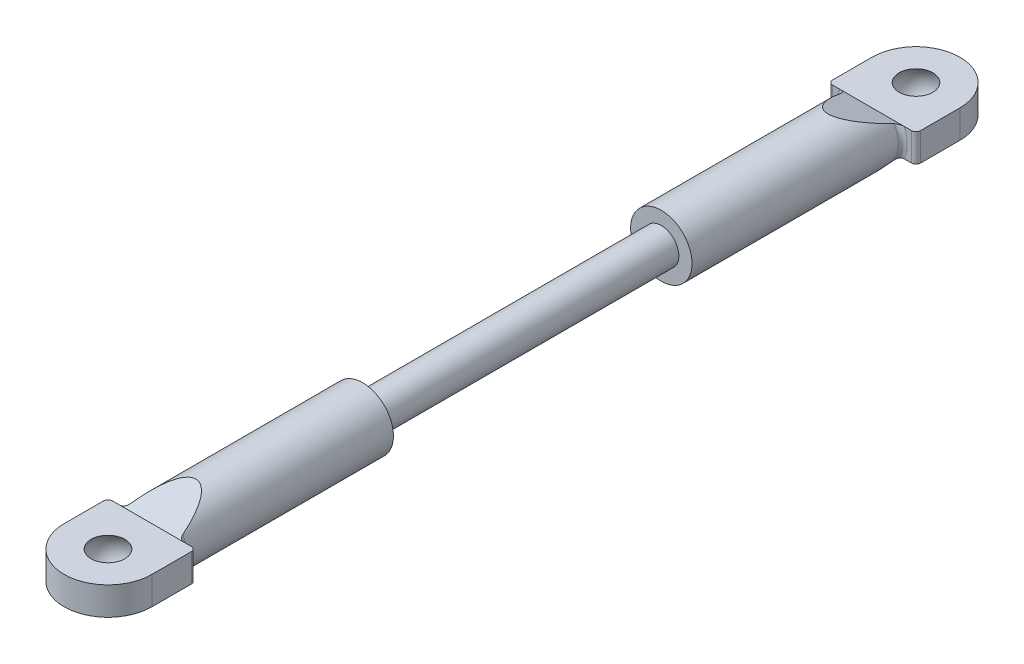
ISO-10303-21;
HEADER;
FILE_DESCRIPTION(('STEP AP214'),'2;1');
FILE_NAME('part.step','',(''),(''),'','','');
FILE_SCHEMA(('AUTOMOTIVE_DESIGN { 1 0 10303 214 1 1 1 1 }'));
ENDSEC;
DATA;
#1=APPLICATION_CONTEXT('core data for automotive mechanical design processes');
#2=APPLICATION_PROTOCOL_DEFINITION('international standard','automotive_design',2000,#1);
#3=PRODUCT_CONTEXT('',#1,'mechanical');
#4=PRODUCT('Part','Part','',(#3));
#5=PRODUCT_RELATED_PRODUCT_CATEGORY('part','',(#4));
#6=PRODUCT_DEFINITION_FORMATION('','',#4);
#7=PRODUCT_DEFINITION_CONTEXT('part definition',#1,'design');
#8=PRODUCT_DEFINITION('design','',#6,#7);
#9=PRODUCT_DEFINITION_SHAPE('','',#8);
#10=(LENGTH_UNIT() NAMED_UNIT(*) SI_UNIT(.MILLI.,.METRE.));
#11=(NAMED_UNIT(*) PLANE_ANGLE_UNIT() SI_UNIT($,.RADIAN.));
#12=(NAMED_UNIT(*) SI_UNIT($,.STERADIAN.) SOLID_ANGLE_UNIT());
#13=UNCERTAINTY_MEASURE_WITH_UNIT(LENGTH_MEASURE(1.E-05),#10,'distance_accuracy_value','');
#14=(GEOMETRIC_REPRESENTATION_CONTEXT(3) GLOBAL_UNCERTAINTY_ASSIGNED_CONTEXT((#13)) GLOBAL_UNIT_ASSIGNED_CONTEXT((#10,
#11,#12)) REPRESENTATION_CONTEXT('',''));
#15=CARTESIAN_POINT('',(0.,0.,0.));
#16=DIRECTION('',(0.,0.,1.));
#17=DIRECTION('',(1.,0.,0.));
#18=AXIS2_PLACEMENT_3D('',#15,#16,#17);
#19=CARTESIAN_POINT('',(0.,0.,-41.));
#20=DIRECTION('',(0.,0.,1.));
#21=DIRECTION('',(1.,0.,0.));
#22=AXIS2_PLACEMENT_3D('',#19,#20,#21);
#23=CYLINDRICAL_SURFACE('',#22,3.5);
#24=CARTESIAN_POINT('',(0.,0.,-17.));
#25=DIRECTION('',(0.,0.,1.));
#26=DIRECTION('',(1.,0.,0.));
#27=AXIS2_PLACEMENT_3D('',#24,#25,#26);
#28=CIRCLE('',#27,3.5);
#29=CARTESIAN_POINT('',(3.5,0.,-17.));
#30=VERTEX_POINT('',#29);
#31=EDGE_CURVE('E184',#30,#30,#28,.T.);
#32=ORIENTED_EDGE('',*,*,#31,.F.);
#33=EDGE_LOOP('',(#32));
#34=FACE_BOUND('',#33,.T.);
#35=CARTESIAN_POINT('',(0.,0.,-45.2105263157895));
#36=DIRECTION('',(0.,0.934783580588349,-0.355217760623573));
#37=DIRECTION('',(0.,0.355217760623573,0.934783580588349));
#38=AXIS2_PLACEMENT_3D('',#35,#36,#37);
#39=ELLIPSE('',#38,9.8531109307594,3.5);
#40=CARTESIAN_POINT('',(3.00764027104306,1.79,-40.5));
#41=VERTEX_POINT('',#40);
#42=CARTESIAN_POINT('',(-3.00764027104306,1.79,-40.5));
#43=VERTEX_POINT('',#42);
#44=EDGE_CURVE('E517',#41,#43,#39,.F.);
#45=ORIENTED_EDGE('',*,*,#44,.T.);
#46=CARTESIAN_POINT('',(0.,0.,-40.5));
#47=DIRECTION('',(0.,0.,1.));
#48=DIRECTION('',(1.,0.,0.));
#49=AXIS2_PLACEMENT_3D('',#46,#47,#48);
#50=CIRCLE('',#49,3.5);
#51=CARTESIAN_POINT('',(-3.00764027104306,-1.79,-40.5));
#52=VERTEX_POINT('',#51);
#53=EDGE_CURVE('E369',#43,#52,#50,.T.);
#54=ORIENTED_EDGE('',*,*,#53,.T.);
#55=CARTESIAN_POINT('',(0.,0.,-45.2105263157895));
#56=DIRECTION('',(0.,-0.934783580588349,-0.355217760623573));
#57=DIRECTION('',(0.,-0.355217760623573,0.934783580588349));
#58=AXIS2_PLACEMENT_3D('',#55,#56,#57);
#59=ELLIPSE('',#58,9.8531109307594,3.5);
#60=CARTESIAN_POINT('',(3.00764027104306,-1.79,-40.5));
#61=VERTEX_POINT('',#60);
#62=EDGE_CURVE('E208',#52,#61,#59,.F.);
#63=ORIENTED_EDGE('',*,*,#62,.T.);
#64=CARTESIAN_POINT('',(0.,0.,-40.5));
#65=DIRECTION('',(0.,0.,1.));
#66=DIRECTION('',(1.,0.,0.));
#67=AXIS2_PLACEMENT_3D('',#64,#65,#66);
#68=CIRCLE('',#67,3.5);
#69=EDGE_CURVE('E366',#61,#41,#68,.T.);
#70=ORIENTED_EDGE('',*,*,#69,.T.);
#71=EDGE_LOOP('',(#45,#54,#63,#70));
#72=FACE_BOUND('',#71,.T.);
#73=ADVANCED_FACE('F34',(#34,#72),#23,.T.);
#74=CARTESIAN_POINT('',(0.,0.,17.));
#75=DIRECTION('',(0.,0.,-1.));
#76=DIRECTION('',(-1.,0.,0.));
#77=AXIS2_PLACEMENT_3D('',#74,#75,#76);
#78=CYLINDRICAL_SURFACE('',#77,2.);
#79=CARTESIAN_POINT('',(0.,0.,17.));
#80=DIRECTION('',(0.,0.,1.));
#81=DIRECTION('',(1.,0.,0.));
#82=AXIS2_PLACEMENT_3D('',#79,#80,#81);
#83=CIRCLE('',#82,2.);
#84=CARTESIAN_POINT('',(2.,0.,17.));
#85=VERTEX_POINT('',#84);
#86=EDGE_CURVE('E267',#85,#85,#83,.T.);
#87=ORIENTED_EDGE('',*,*,#86,.F.);
#88=EDGE_LOOP('',(#87));
#89=FACE_BOUND('',#88,.T.);
#90=CARTESIAN_POINT('',(0.,0.,-17.));
#91=DIRECTION('',(0.,0.,-1.));
#92=DIRECTION('',(-1.,0.,0.));
#93=AXIS2_PLACEMENT_3D('',#90,#91,#92);
#94=CIRCLE('',#93,2.);
#95=CARTESIAN_POINT('',(-2.,0.,-17.));
#96=VERTEX_POINT('',#95);
#97=EDGE_CURVE('E219',#96,#96,#94,.T.);
#98=ORIENTED_EDGE('',*,*,#97,.F.);
#99=EDGE_LOOP('',(#98));
#100=FACE_BOUND('',#99,.T.);
#101=ADVANCED_FACE('F429',(#89,#100),#78,.T.);
#102=CARTESIAN_POINT('',(0.,0.,41.));
#103=DIRECTION('',(0.,0.,-1.));
#104=DIRECTION('',(-1.,0.,0.));
#105=AXIS2_PLACEMENT_3D('',#102,#103,#104);
#106=CYLINDRICAL_SURFACE('',#105,3.5);
#107=CARTESIAN_POINT('',(0.,0.,45.2105263157895));
#108=DIRECTION('',(0.,0.934783580588349,-0.355217760623573));
#109=DIRECTION('',(0.,-0.355217760623573,-0.934783580588349));
#110=AXIS2_PLACEMENT_3D('',#107,#108,#109);
#111=ELLIPSE('',#110,9.8531109307594,3.5);
#112=CARTESIAN_POINT('',(3.00764027104306,-1.79,40.5));
#113=VERTEX_POINT('',#112);
#114=CARTESIAN_POINT('',(-3.00764027104306,-1.79,40.5));
#115=VERTEX_POINT('',#114);
#116=EDGE_CURVE('E231',#113,#115,#111,.T.);
#117=ORIENTED_EDGE('',*,*,#116,.T.);
#118=CARTESIAN_POINT('',(0.,0.,40.5));
#119=DIRECTION('',(0.,0.,1.));
#120=DIRECTION('',(1.,0.,0.));
#121=AXIS2_PLACEMENT_3D('',#118,#119,#120);
#122=CIRCLE('',#121,3.5);
#123=CARTESIAN_POINT('',(-3.00764027104306,1.79,40.5));
#124=VERTEX_POINT('',#123);
#125=EDGE_CURVE('E288',#115,#124,#122,.F.);
#126=ORIENTED_EDGE('',*,*,#125,.T.);
#127=CARTESIAN_POINT('',(0.,0.,45.2105263157895));
#128=DIRECTION('',(0.,-0.934783580588349,-0.355217760623573));
#129=DIRECTION('',(0.,0.355217760623573,-0.934783580588349));
#130=AXIS2_PLACEMENT_3D('',#127,#128,#129);
#131=ELLIPSE('',#130,9.8531109307594,3.5);
#132=CARTESIAN_POINT('',(3.00764027104306,1.79,40.5));
#133=VERTEX_POINT('',#132);
#134=EDGE_CURVE('E228',#124,#133,#131,.T.);
#135=ORIENTED_EDGE('',*,*,#134,.T.);
#136=CARTESIAN_POINT('',(0.,0.,40.5));
#137=DIRECTION('',(0.,0.,1.));
#138=DIRECTION('',(1.,0.,0.));
#139=AXIS2_PLACEMENT_3D('',#136,#137,#138);
#140=CIRCLE('',#139,3.5);
#141=EDGE_CURVE('E286',#133,#113,#140,.F.);
#142=ORIENTED_EDGE('',*,*,#141,.T.);
#143=EDGE_LOOP('',(#117,#126,#135,#142));
#144=FACE_BOUND('',#143,.T.);
#145=CARTESIAN_POINT('',(0.,0.,17.));
#146=DIRECTION('',(0.,0.,1.));
#147=DIRECTION('',(1.,0.,0.));
#148=AXIS2_PLACEMENT_3D('',#145,#146,#147);
#149=CIRCLE('',#148,3.5);
#150=CARTESIAN_POINT('',(3.5,0.,17.));
#151=VERTEX_POINT('',#150);
#152=EDGE_CURVE('E264',#151,#151,#149,.T.);
#153=ORIENTED_EDGE('',*,*,#152,.T.);
#154=EDGE_LOOP('',(#153));
#155=FACE_BOUND('',#154,.T.);
#156=ADVANCED_FACE('F490',(#144,#155),#106,.T.);
#157=CARTESIAN_POINT('',(0.,0.,17.));
#158=DIRECTION('',(0.,0.,1.));
#159=DIRECTION('',(1.,0.,0.));
#160=AXIS2_PLACEMENT_3D('',#157,#158,#159);
#161=PLANE('',#160);
#162=ORIENTED_EDGE('',*,*,#86,.T.);
#163=EDGE_LOOP('',(#162));
#164=FACE_BOUND('',#163,.T.);
#165=ORIENTED_EDGE('',*,*,#152,.F.);
#166=EDGE_LOOP('',(#165));
#167=FACE_BOUND('',#166,.T.);
#168=ADVANCED_FACE('F493',(#164,#167),#161,.F.);
#169=CARTESIAN_POINT('',(4.99999999999988,1.6,41.));
#170=DIRECTION('',(0.,0.,1.));
#171=DIRECTION('',(1.,0.,0.));
#172=AXIS2_PLACEMENT_3D('',#169,#170,#171);
#173=PLANE('',#172);
#174=DIRECTION('',(-1.,0.,0.));
#175=VECTOR('',#174,1.);
#176=CARTESIAN_POINT('',(4.99999999999988,-1.6,41.));
#177=LINE('',#176,#175);
#178=CARTESIAN_POINT('',(-3.66606055596467,-1.6,41.));
#179=VERTEX_POINT('',#178);
#180=CARTESIAN_POINT('',(-4.50000000000012,-1.6,41.));
#181=VERTEX_POINT('',#180);
#182=EDGE_CURVE('E251',#179,#181,#177,.T.);
#183=ORIENTED_EDGE('',*,*,#182,.T.);
#184=DIRECTION('',(0.,-1.,0.));
#185=VECTOR('',#184,1.);
#186=CARTESIAN_POINT('',(-4.50000000000012,1.6,41.));
#187=LINE('',#186,#185);
#188=CARTESIAN_POINT('',(-4.50000000000012,1.6,41.));
#189=VERTEX_POINT('',#188);
#190=EDGE_CURVE('E280',#181,#189,#187,.F.);
#191=ORIENTED_EDGE('',*,*,#190,.T.);
#192=DIRECTION('',(-1.,0.,0.));
#193=VECTOR('',#192,1.);
#194=CARTESIAN_POINT('',(4.99999999999988,1.6,41.));
#195=LINE('',#194,#193);
#196=CARTESIAN_POINT('',(-3.66606055596467,1.6,41.));
#197=VERTEX_POINT('',#196);
#198=EDGE_CURVE('E238',#197,#189,#195,.T.);
#199=ORIENTED_EDGE('',*,*,#198,.F.);
#200=CARTESIAN_POINT('',(0.,0.,41.));
#201=DIRECTION('',(0.,0.,1.));
#202=DIRECTION('',(1.,0.,0.));
#203=AXIS2_PLACEMENT_3D('',#200,#201,#202);
#204=CIRCLE('',#203,4.);
#205=EDGE_CURVE('E277',#197,#179,#204,.T.);
#206=ORIENTED_EDGE('',*,*,#205,.T.);
#207=EDGE_LOOP('',(#183,#191,#199,#206));
#208=FACE_BOUND('',#207,.T.);
#209=ADVANCED_FACE('F458',(#208),#173,.F.);
#210=CARTESIAN_POINT('',(4.49999999999988,1.6,41.));
#211=VERTEX_POINT('',#210);
#212=CARTESIAN_POINT('',(3.66606055596467,1.6,41.));
#213=VERTEX_POINT('',#212);
#214=EDGE_CURVE('E240',#211,#213,#195,.T.);
#215=ORIENTED_EDGE('',*,*,#214,.F.);
#216=DIRECTION('',(0.,-1.,0.));
#217=VECTOR('',#216,1.);
#218=CARTESIAN_POINT('',(4.49999999999988,1.6,41.));
#219=LINE('',#218,#217);
#220=CARTESIAN_POINT('',(4.49999999999988,-1.6,41.));
#221=VERTEX_POINT('',#220);
#222=EDGE_CURVE('E293',#211,#221,#219,.T.);
#223=ORIENTED_EDGE('',*,*,#222,.T.);
#224=CARTESIAN_POINT('',(3.66606055596467,-1.6,41.));
#225=VERTEX_POINT('',#224);
#226=EDGE_CURVE('E252',#221,#225,#177,.T.);
#227=ORIENTED_EDGE('',*,*,#226,.T.);
#228=CARTESIAN_POINT('',(0.,0.,41.));
#229=DIRECTION('',(0.,0.,1.));
#230=DIRECTION('',(1.,0.,0.));
#231=AXIS2_PLACEMENT_3D('',#228,#229,#230);
#232=CIRCLE('',#231,4.);
#233=EDGE_CURVE('E290',#225,#213,#232,.T.);
#234=ORIENTED_EDGE('',*,*,#233,.T.);
#235=EDGE_LOOP('',(#215,#223,#227,#234));
#236=FACE_BOUND('',#235,.T.);
#237=ADVANCED_FACE('F486',(#236),#173,.F.);
#238=CARTESIAN_POINT('',(4.99999999999988,1.6,41.));
#239=DIRECTION('',(-1.,0.,0.));
#240=DIRECTION('',(0.,0.,1.));
#241=AXIS2_PLACEMENT_3D('',#238,#239,#240);
#242=PLANE('',#241);
#243=DIRECTION('',(0.,0.,-1.));
#244=VECTOR('',#243,1.);
#245=CARTESIAN_POINT('',(4.99999999999988,-1.6,41.));
#246=LINE('',#245,#244);
#247=CARTESIAN_POINT('',(4.99999999999988,-1.6,46.));
#248=VERTEX_POINT('',#247);
#249=CARTESIAN_POINT('',(4.99999999999988,-1.6,41.5));
#250=VERTEX_POINT('',#249);
#251=EDGE_CURVE('E234',#248,#250,#246,.T.);
#252=ORIENTED_EDGE('',*,*,#251,.T.);
#253=DIRECTION('',(0.,-1.,0.));
#254=VECTOR('',#253,1.);
#255=CARTESIAN_POINT('',(4.99999999999988,1.6,41.5));
#256=LINE('',#255,#254);
#257=CARTESIAN_POINT('',(4.99999999999988,1.6,41.5));
#258=VERTEX_POINT('',#257);
#259=EDGE_CURVE('E296',#250,#258,#256,.F.);
#260=ORIENTED_EDGE('',*,*,#259,.T.);
#261=DIRECTION('',(0.,0.,-1.));
#262=VECTOR('',#261,1.);
#263=CARTESIAN_POINT('',(4.99999999999988,1.6,41.));
#264=LINE('',#263,#262);
#265=CARTESIAN_POINT('',(4.99999999999988,1.6,46.));
#266=VERTEX_POINT('',#265);
#267=EDGE_CURVE('E235',#266,#258,#264,.T.);
#268=ORIENTED_EDGE('',*,*,#267,.F.);
#269=DIRECTION('',(0.,-1.,0.));
#270=VECTOR('',#269,1.);
#271=CARTESIAN_POINT('',(4.99999999999988,1.6,46.));
#272=LINE('',#271,#270);
#273=EDGE_CURVE('E248',#266,#248,#272,.T.);
#274=ORIENTED_EDGE('',*,*,#273,.T.);
#275=EDGE_LOOP('',(#252,#260,#268,#274));
#276=FACE_BOUND('',#275,.T.);
#277=ADVANCED_FACE('F480',(#276),#242,.F.);
#278=CARTESIAN_POINT('',(-5.00000000000012,1.6,41.));
#279=DIRECTION('',(1.,0.,0.));
#280=DIRECTION('',(0.,0.,-1.));
#281=AXIS2_PLACEMENT_3D('',#278,#279,#280);
#282=PLANE('',#281);
#283=DIRECTION('',(0.,0.,1.));
#284=VECTOR('',#283,1.);
#285=CARTESIAN_POINT('',(-5.00000000000012,1.6,41.));
#286=LINE('',#285,#284);
#287=CARTESIAN_POINT('',(-5.00000000000012,1.6,41.5));
#288=VERTEX_POINT('',#287);
#289=CARTESIAN_POINT('',(-5.00000000000012,1.6,46.));
#290=VERTEX_POINT('',#289);
#291=EDGE_CURVE('E243',#288,#290,#286,.T.);
#292=ORIENTED_EDGE('',*,*,#291,.F.);
#293=DIRECTION('',(0.,-1.,0.));
#294=VECTOR('',#293,1.);
#295=CARTESIAN_POINT('',(-5.00000000000012,1.6,41.5));
#296=LINE('',#295,#294);
#297=CARTESIAN_POINT('',(-5.00000000000012,-1.6,41.5));
#298=VERTEX_POINT('',#297);
#299=EDGE_CURVE('E270',#288,#298,#296,.T.);
#300=ORIENTED_EDGE('',*,*,#299,.T.);
#301=DIRECTION('',(0.,0.,1.));
#302=VECTOR('',#301,1.);
#303=CARTESIAN_POINT('',(-5.00000000000012,-1.6,41.));
#304=LINE('',#303,#302);
#305=CARTESIAN_POINT('',(-5.00000000000012,-1.6,46.));
#306=VERTEX_POINT('',#305);
#307=EDGE_CURVE('E255',#298,#306,#304,.T.);
#308=ORIENTED_EDGE('',*,*,#307,.T.);
#309=DIRECTION('',(0.,-1.,0.));
#310=VECTOR('',#309,1.);
#311=CARTESIAN_POINT('',(-5.00000000000012,1.6,46.));
#312=LINE('',#311,#310);
#313=EDGE_CURVE('E261',#290,#306,#312,.T.);
#314=ORIENTED_EDGE('',*,*,#313,.F.);
#315=EDGE_LOOP('',(#292,#300,#308,#314));
#316=FACE_BOUND('',#315,.T.);
#317=ADVANCED_FACE('F470',(#316),#282,.F.);
#318=CARTESIAN_POINT('',(-1.14925430283463E-13,1.6,46.));
#319=DIRECTION('',(0.,-1.,0.));
#320=DIRECTION('',(0.,0.,-1.));
#321=AXIS2_PLACEMENT_3D('',#318,#319,#320);
#322=CYLINDRICAL_SURFACE('',#321,5.);
#323=CARTESIAN_POINT('',(-1.14925430283463E-13,-1.6,46.));
#324=DIRECTION('',(0.,1.,0.));
#325=DIRECTION('',(0.,0.,1.));
#326=AXIS2_PLACEMENT_3D('',#323,#324,#325);
#327=CIRCLE('',#326,5.);
#328=EDGE_CURVE('E239',#306,#248,#327,.T.);
#329=ORIENTED_EDGE('',*,*,#328,.T.);
#330=ORIENTED_EDGE('',*,*,#273,.F.);
#331=CARTESIAN_POINT('',(-1.14925430283463E-13,1.6,46.));
#332=DIRECTION('',(0.,1.,0.));
#333=DIRECTION('',(0.,0.,1.));
#334=AXIS2_PLACEMENT_3D('',#331,#332,#333);
#335=CIRCLE('',#334,5.);
#336=EDGE_CURVE('E246',#290,#266,#335,.T.);
#337=ORIENTED_EDGE('',*,*,#336,.F.);
#338=ORIENTED_EDGE('',*,*,#313,.T.);
#339=EDGE_LOOP('',(#329,#330,#337,#338));
#340=FACE_BOUND('',#339,.T.);
#341=ADVANCED_FACE('F476',(#340),#322,.T.);
#342=CARTESIAN_POINT('',(-1.14925430283463E-13,1.6,46.));
#343=DIRECTION('',(0.,1.,0.));
#344=DIRECTION('',(0.,0.,1.));
#345=AXIS2_PLACEMENT_3D('',#342,#343,#344);
#346=PLANE('',#345);
#347=CARTESIAN_POINT('',(0.,1.6,46.));
#348=DIRECTION('',(0.,-1.,0.));
#349=DIRECTION('',(0.,0.,-1.));
#350=AXIS2_PLACEMENT_3D('',#347,#348,#349);
#351=CIRCLE('',#350,1.92093727122986);
#352=CARTESIAN_POINT('',(0.,1.6,44.0790627287702));
#353=VERTEX_POINT('',#352);
#354=EDGE_CURVE('E225',#353,#353,#351,.T.);
#355=ORIENTED_EDGE('',*,*,#354,.T.);
#356=EDGE_LOOP('',(#355));
#357=FACE_BOUND('',#356,.T.);
#358=ORIENTED_EDGE('',*,*,#198,.T.);
#359=CARTESIAN_POINT('',(-4.50000000000012,1.6,41.5));
#360=DIRECTION('',(0.,1.,0.));
#361=DIRECTION('',(0.,0.,1.));
#362=AXIS2_PLACEMENT_3D('',#359,#360,#361);
#363=CIRCLE('',#362,0.5);
#364=EDGE_CURVE('E284',#189,#288,#363,.T.);
#365=ORIENTED_EDGE('',*,*,#364,.T.);
#366=ORIENTED_EDGE('',*,*,#291,.T.);
#367=ORIENTED_EDGE('',*,*,#336,.T.);
#368=ORIENTED_EDGE('',*,*,#267,.T.);
#369=CARTESIAN_POINT('',(4.49999999999988,1.6,41.5));
#370=DIRECTION('',(0.,1.,0.));
#371=DIRECTION('',(0.,0.,1.));
#372=AXIS2_PLACEMENT_3D('',#369,#370,#371);
#373=CIRCLE('',#372,0.5);
#374=EDGE_CURVE('E282',#258,#211,#373,.T.);
#375=ORIENTED_EDGE('',*,*,#374,.T.);
#376=ORIENTED_EDGE('',*,*,#214,.T.);
#377=EDGE_CURVE('E244',#213,#197,#195,.T.);
#378=ORIENTED_EDGE('',*,*,#377,.T.);
#379=EDGE_LOOP('',(#358,#365,#366,#367,#368,#375,#376,#378));
#380=FACE_BOUND('',#379,.T.);
#381=ADVANCED_FACE('F466',(#357,#380),#346,.T.);
#382=CARTESIAN_POINT('',(-1.14925430283463E-13,-1.6,46.));
#383=DIRECTION('',(0.,1.,0.));
#384=DIRECTION('',(0.,0.,1.));
#385=AXIS2_PLACEMENT_3D('',#382,#383,#384);
#386=PLANE('',#385);
#387=CARTESIAN_POINT('',(0.,-1.6,46.));
#388=DIRECTION('',(0.,-1.,0.));
#389=DIRECTION('',(0.,0.,-1.));
#390=AXIS2_PLACEMENT_3D('',#387,#388,#389);
#391=CIRCLE('',#390,1.92093727122986);
#392=CARTESIAN_POINT('',(0.,-1.6,44.0790627287702));
#393=VERTEX_POINT('',#392);
#394=EDGE_CURVE('E222',#393,#393,#391,.T.);
#395=ORIENTED_EDGE('',*,*,#394,.F.);
#396=EDGE_LOOP('',(#395));
#397=FACE_BOUND('',#396,.T.);
#398=ORIENTED_EDGE('',*,*,#307,.F.);
#399=CARTESIAN_POINT('',(-4.50000000000012,-1.6,41.5));
#400=DIRECTION('',(0.,1.,0.));
#401=DIRECTION('',(0.,0.,1.));
#402=AXIS2_PLACEMENT_3D('',#399,#400,#401);
#403=CIRCLE('',#402,0.5);
#404=EDGE_CURVE('E275',#298,#181,#403,.F.);
#405=ORIENTED_EDGE('',*,*,#404,.T.);
#406=ORIENTED_EDGE('',*,*,#182,.F.);
#407=EDGE_CURVE('E256',#225,#179,#177,.T.);
#408=ORIENTED_EDGE('',*,*,#407,.F.);
#409=ORIENTED_EDGE('',*,*,#226,.F.);
#410=CARTESIAN_POINT('',(4.49999999999988,-1.6,41.5));
#411=DIRECTION('',(0.,1.,0.));
#412=DIRECTION('',(0.,0.,1.));
#413=AXIS2_PLACEMENT_3D('',#410,#411,#412);
#414=CIRCLE('',#413,0.5);
#415=EDGE_CURVE('E273',#221,#250,#414,.F.);
#416=ORIENTED_EDGE('',*,*,#415,.T.);
#417=ORIENTED_EDGE('',*,*,#251,.F.);
#418=ORIENTED_EDGE('',*,*,#328,.F.);
#419=EDGE_LOOP('',(#398,#405,#406,#408,#409,#416,#417,#418));
#420=FACE_BOUND('',#419,.T.);
#421=ADVANCED_FACE('F443',(#397,#420),#386,.F.);
#422=CARTESIAN_POINT('',(-5.00000000000012,-3.5,36.));
#423=DIRECTION('',(0.,0.934783580588349,-0.355217760623573));
#424=DIRECTION('',(0.,0.355217760623573,0.934783580588349));
#425=AXIS2_PLACEMENT_3D('',#422,#423,#424);
#426=PLANE('',#425);
#427=ORIENTED_EDGE('',*,*,#116,.F.);
#428=CARTESIAN_POINT('',(3.00764027104306,-1.79,40.5));
#429=CARTESIAN_POINT('',(3.01501660801302,-1.77766028795213,40.5324729264418));
#430=CARTESIAN_POINT('',(3.02572054444839,-1.76562370557432,40.5641481432255));
#431=CARTESIAN_POINT('',(3.05268143397384,-1.74243941655702,40.6251594301131));
#432=CARTESIAN_POINT('',(3.06890462643524,-1.73128680248825,40.6545084145046));
#433=CARTESIAN_POINT('',(3.10582578109096,-1.71005107968239,40.7103918955726));
#434=CARTESIAN_POINT('',(3.12650175541777,-1.69996306618932,40.7369392995018));
#435=CARTESIAN_POINT('',(3.17173377932212,-1.68091062474513,40.7870773033023));
#436=CARTESIAN_POINT('',(3.19630000983909,-1.67194925885705,40.810659845113));
#437=CARTESIAN_POINT('',(3.25308702665305,-1.65394324157303,40.8580441011236));
#438=CARTESIAN_POINT('',(3.28590126291054,-1.64513316555967,40.8812285116851));
#439=CARTESIAN_POINT('',(3.35512262024705,-1.62958502321958,40.922144675738));
#440=CARTESIAN_POINT('',(3.39152193222907,-1.62284257946172,40.939887948785));
#441=CARTESIAN_POINT('',(3.46667654312686,-1.61181855552478,40.9688985380927));
#442=CARTESIAN_POINT('',(3.50539569079468,-1.60750655943475,40.9802458962243));
#443=CARTESIAN_POINT('',(3.58468972563839,-1.60158887924979,40.9958187388163));
#444=CARTESIAN_POINT('',(3.62527552224046,-1.60000196579963,40.9999948268431));
#445=CARTESIAN_POINT('',(3.66606055596467,-1.6,41.));
#446=B_SPLINE_CURVE_WITH_KNOTS('',3,(#428,#429,#430,#431,#432,#433,#434,#435,#436,#437,#438,
#439,#440,#441,#442,#443,#444,#445),.UNSPECIFIED.,.F.,.F.,(4,2,2,2,2,2,2,2,4),(0.,
0.106167992198204,0.211697907824557,0.316718199165377,0.422018018143723,0.544850735918062,
0.667421577236032,0.788422358006248,0.910253310178007),.UNSPECIFIED.);
#447=EDGE_CURVE('E344',#113,#225,#446,.T.);
#448=ORIENTED_EDGE('',*,*,#447,.T.);
#449=ORIENTED_EDGE('',*,*,#407,.T.);
#450=CARTESIAN_POINT('',(-3.66606055596467,-1.6,41.));
#451=CARTESIAN_POINT('',(-3.63078063888977,-1.60000001056058,40.999999972209));
#452=CARTESIAN_POINT('',(-3.5956179181408,-1.60118986581098,40.9968687741816));
#453=CARTESIAN_POINT('',(-3.52655388189509,-1.60567025143002,40.9850782857105));
#454=CARTESIAN_POINT('',(-3.49264665949915,-1.60894911259673,40.9764497036928));
#455=CARTESIAN_POINT('',(-3.42683574135487,-1.61731864154893,40.9544246275028));
#456=CARTESIAN_POINT('',(-3.39492497711937,-1.62240243525609,40.9410462230103));
#457=CARTESIAN_POINT('',(-3.33346675755787,-1.63416518792784,40.9100916107162));
#458=CARTESIAN_POINT('',(-3.30392365430699,-1.64084699836385,40.8925078990425));
#459=CARTESIAN_POINT('',(-3.24361803739982,-1.65669629654687,40.8507992196135));
#460=CARTESIAN_POINT('',(-3.21331454976661,-1.66608478340738,40.8260926752437));
#461=CARTESIAN_POINT('',(-3.15729695298565,-1.68646854640408,40.7724511936735));
#462=CARTESIAN_POINT('',(-3.13158499781672,-1.69746457229264,40.7435142834404));
#463=CARTESIAN_POINT('',(-3.08849280363673,-1.71942769351274,40.6857165960191));
#464=CARTESIAN_POINT('',(-3.07048210952563,-1.73023882163715,40.6572662588496));
#465=CARTESIAN_POINT('',(-3.03967295120166,-1.7527379284266,40.5980580830879));
#466=CARTESIAN_POINT('',(-3.026855560671,-1.7644225359027,40.5673091160455));
#467=CARTESIAN_POINT('',(-3.01354455450079,-1.78090239560611,40.5239410641945));
#468=CARTESIAN_POINT('',(-3.01035806349222,-1.78543358828867,40.5120168729246));
#469=CARTESIAN_POINT('',(-3.00764027104306,-1.79,40.5));
#470=B_SPLINE_CURVE_WITH_KNOTS('',3,(#450,#451,#452,#453,#454,#455,#456,#457,#458,#459,#460,
#461,#462,#463,#464,#465,#466,#467,#468,#469),.UNSPECIFIED.,.F.,.F.,(4,2,2,2,2,2,2,2,2,4),(0.,
0.105514918398724,0.210445536564004,0.314980739690672,0.419703883801088,0.539819680998126,
0.659991679707302,0.765692662085833,0.871004889168675,0.910420537913499),.UNSPECIFIED.);
#471=EDGE_CURVE('E298',#179,#115,#470,.T.);
#472=ORIENTED_EDGE('',*,*,#471,.T.);
#473=EDGE_LOOP('',(#427,#448,#449,#472));
#474=FACE_BOUND('',#473,.T.);
#475=ADVANCED_FACE('F313',(#474),#426,.F.);
#476=CARTESIAN_POINT('',(-5.00000000000012,3.5,36.));
#477=DIRECTION('',(0.,-0.934783580588349,-0.355217760623573));
#478=DIRECTION('',(0.,0.355217760623573,-0.934783580588349));
#479=AXIS2_PLACEMENT_3D('',#476,#477,#478);
#480=PLANE('',#479);
#481=ORIENTED_EDGE('',*,*,#134,.F.);
#482=CARTESIAN_POINT('',(-3.00764027104306,1.79,40.5));
#483=CARTESIAN_POINT('',(-3.01501660801302,1.77766028795213,40.5324729264418));
#484=CARTESIAN_POINT('',(-3.02572054444839,1.76562370557432,40.5641481432255));
#485=CARTESIAN_POINT('',(-3.05268143397384,1.74243941655702,40.6251594301131));
#486=CARTESIAN_POINT('',(-3.06890462643524,1.73128680248825,40.6545084145046));
#487=CARTESIAN_POINT('',(-3.10582578109096,1.71005107968239,40.7103918955726));
#488=CARTESIAN_POINT('',(-3.12650175541777,1.69996306618932,40.7369392995018));
#489=CARTESIAN_POINT('',(-3.17173377932212,1.68091062474513,40.7870773033023));
#490=CARTESIAN_POINT('',(-3.19630000983909,1.67194925885705,40.810659845113));
#491=CARTESIAN_POINT('',(-3.25308702665305,1.65394324157303,40.8580441011236));
#492=CARTESIAN_POINT('',(-3.28590126291054,1.64513316555967,40.8812285116851));
#493=CARTESIAN_POINT('',(-3.35512262024705,1.62958502321958,40.922144675738));
#494=CARTESIAN_POINT('',(-3.39152193222907,1.62284257946172,40.939887948785));
#495=CARTESIAN_POINT('',(-3.46667654312686,1.61181855552478,40.9688985380927));
#496=CARTESIAN_POINT('',(-3.50539569079468,1.60750655943475,40.9802458962243));
#497=CARTESIAN_POINT('',(-3.58468972563839,1.60158887924979,40.9958187388163));
#498=CARTESIAN_POINT('',(-3.62527552224046,1.60000196579963,40.9999948268431));
#499=CARTESIAN_POINT('',(-3.66606055596467,1.6,41.));
#500=B_SPLINE_CURVE_WITH_KNOTS('',3,(#482,#483,#484,#485,#486,#487,#488,#489,#490,#491,#492,
#493,#494,#495,#496,#497,#498,#499),.UNSPECIFIED.,.F.,.F.,(4,2,2,2,2,2,2,2,4),(0.,
0.106167992198204,0.211697907824557,0.316718199165377,0.422018018143723,0.544850735918062,
0.667421577236032,0.788422358006248,0.910253310178008),.UNSPECIFIED.);
#501=EDGE_CURVE('E306',#124,#197,#500,.T.);
#502=ORIENTED_EDGE('',*,*,#501,.T.);
#503=ORIENTED_EDGE('',*,*,#377,.F.);
#504=CARTESIAN_POINT('',(3.66606055596467,1.6,41.));
#505=CARTESIAN_POINT('',(3.63078063888977,1.60000001056058,40.999999972209));
#506=CARTESIAN_POINT('',(3.5956179181408,1.60118986581098,40.9968687741816));
#507=CARTESIAN_POINT('',(3.52655388189509,1.60567025143002,40.9850782857105));
#508=CARTESIAN_POINT('',(3.49264665949915,1.60894911259673,40.9764497036928));
#509=CARTESIAN_POINT('',(3.42683574135487,1.61731864154893,40.9544246275028));
#510=CARTESIAN_POINT('',(3.39492497711937,1.62240243525609,40.9410462230103));
#511=CARTESIAN_POINT('',(3.33346675755787,1.63416518792784,40.9100916107162));
#512=CARTESIAN_POINT('',(3.30392365430699,1.64084699836385,40.8925078990425));
#513=CARTESIAN_POINT('',(3.24361803739982,1.65669629654687,40.8507992196135));
#514=CARTESIAN_POINT('',(3.21331454976661,1.66608478340738,40.8260926752437));
#515=CARTESIAN_POINT('',(3.15729695298565,1.68646854640408,40.7724511936735));
#516=CARTESIAN_POINT('',(3.13158499781672,1.69746457229264,40.7435142834404));
#517=CARTESIAN_POINT('',(3.08849280363673,1.71942769351274,40.6857165960191));
#518=CARTESIAN_POINT('',(3.07048210952563,1.73023882163715,40.6572662588496));
#519=CARTESIAN_POINT('',(3.03967295120166,1.7527379284266,40.5980580830879));
#520=CARTESIAN_POINT('',(3.026855560671,1.7644225359027,40.5673091160455));
#521=CARTESIAN_POINT('',(3.01354455450079,1.78090239560611,40.5239410641945));
#522=CARTESIAN_POINT('',(3.01035806349222,1.78543358828867,40.5120168729246));
#523=CARTESIAN_POINT('',(3.00764027104306,1.79,40.5));
#524=B_SPLINE_CURVE_WITH_KNOTS('',3,(#504,#505,#506,#507,#508,#509,#510,#511,#512,#513,#514,
#515,#516,#517,#518,#519,#520,#521,#522,#523),.UNSPECIFIED.,.F.,.F.,(4,2,2,2,2,2,2,2,2,4),(0.,
0.105514918398724,0.210445536564004,0.314980739690672,0.419703883801088,0.539819680998126,
0.659991679707302,0.765692662085833,0.871004889168674,0.910420537913499),.UNSPECIFIED.);
#525=EDGE_CURVE('E338',#213,#133,#524,.T.);
#526=ORIENTED_EDGE('',*,*,#525,.T.);
#527=EDGE_LOOP('',(#481,#502,#503,#526));
#528=FACE_BOUND('',#527,.T.);
#529=ADVANCED_FACE('F433',(#528),#480,.F.);
#530=CARTESIAN_POINT('',(-4.50000000000012,1.6,41.5));
#531=DIRECTION('',(0.,-1.,0.));
#532=DIRECTION('',(0.,0.,-1.));
#533=AXIS2_PLACEMENT_3D('',#530,#531,#532);
#534=CYLINDRICAL_SURFACE('',#533,0.5);
#535=ORIENTED_EDGE('',*,*,#364,.F.);
#536=ORIENTED_EDGE('',*,*,#190,.F.);
#537=ORIENTED_EDGE('',*,*,#404,.F.);
#538=ORIENTED_EDGE('',*,*,#299,.F.);
#539=EDGE_LOOP('',(#535,#536,#537,#538));
#540=FACE_BOUND('',#539,.T.);
#541=ADVANCED_FACE('F322',(#540),#534,.T.);
#542=CARTESIAN_POINT('',(0.,0.,40.5));
#543=DIRECTION('',(0.,0.,1.));
#544=DIRECTION('',(1.,0.,0.));
#545=AXIS2_PLACEMENT_3D('',#542,#543,#544);
#546=TOROIDAL_SURFACE('',#545,4.,0.5);
#547=ORIENTED_EDGE('',*,*,#501,.F.);
#548=ORIENTED_EDGE('',*,*,#125,.F.);
#549=ORIENTED_EDGE('',*,*,#471,.F.);
#550=ORIENTED_EDGE('',*,*,#205,.F.);
#551=EDGE_LOOP('',(#547,#548,#549,#550));
#552=FACE_BOUND('',#551,.T.);
#553=ADVANCED_FACE('F316',(#552),#546,.F.);
#554=CARTESIAN_POINT('',(4.49999999999988,1.6,41.5));
#555=DIRECTION('',(0.,-1.,0.));
#556=DIRECTION('',(0.,0.,-1.));
#557=AXIS2_PLACEMENT_3D('',#554,#555,#556);
#558=CYLINDRICAL_SURFACE('',#557,0.5);
#559=ORIENTED_EDGE('',*,*,#374,.F.);
#560=ORIENTED_EDGE('',*,*,#259,.F.);
#561=ORIENTED_EDGE('',*,*,#415,.F.);
#562=ORIENTED_EDGE('',*,*,#222,.F.);
#563=EDGE_LOOP('',(#559,#560,#561,#562));
#564=FACE_BOUND('',#563,.T.);
#565=ADVANCED_FACE('F321',(#564),#558,.T.);
#566=CARTESIAN_POINT('',(0.,0.,40.5));
#567=DIRECTION('',(0.,0.,1.));
#568=DIRECTION('',(1.,0.,0.));
#569=AXIS2_PLACEMENT_3D('',#566,#567,#568);
#570=TOROIDAL_SURFACE('',#569,4.,0.5);
#571=ORIENTED_EDGE('',*,*,#447,.F.);
#572=ORIENTED_EDGE('',*,*,#141,.F.);
#573=ORIENTED_EDGE('',*,*,#525,.F.);
#574=ORIENTED_EDGE('',*,*,#233,.F.);
#575=EDGE_LOOP('',(#571,#572,#573,#574));
#576=FACE_BOUND('',#575,.T.);
#577=ADVANCED_FACE('F328',(#576),#570,.F.);
#578=CARTESIAN_POINT('',(0.,0.,46.));
#579=DIRECTION('',(0.,-1.,0.));
#580=DIRECTION('',(0.,0.,1.));
#581=AXIS2_PLACEMENT_3D('',#578,#579,#580);
#582=SPHERICAL_SURFACE('',#581,2.5);
#583=ORIENTED_EDGE('',*,*,#394,.T.);
#584=EDGE_LOOP('',(#583));
#585=FACE_BOUND('',#584,.T.);
#586=ORIENTED_EDGE('',*,*,#354,.F.);
#587=EDGE_LOOP('',(#586));
#588=FACE_BOUND('',#587,.T.);
#589=ADVANCED_FACE('F333',(#585,#588),#582,.F.);
#590=CARTESIAN_POINT('',(0.,0.,-17.));
#591=DIRECTION('',(0.,0.,-1.));
#592=DIRECTION('',(1.,0.,0.));
#593=AXIS2_PLACEMENT_3D('',#590,#591,#592);
#594=PLANE('',#593);
#595=ORIENTED_EDGE('',*,*,#97,.T.);
#596=EDGE_LOOP('',(#595));
#597=FACE_BOUND('',#596,.T.);
#598=ORIENTED_EDGE('',*,*,#31,.T.);
#599=EDGE_LOOP('',(#598));
#600=FACE_BOUND('',#599,.T.);
#601=ADVANCED_FACE('F415',(#597,#600),#594,.F.);
#602=CARTESIAN_POINT('',(4.99999999999988,1.6,-41.));
#603=DIRECTION('',(0.,0.,1.));
#604=DIRECTION('',(1.,0.,0.));
#605=AXIS2_PLACEMENT_3D('',#602,#603,#604);
#606=PLANE('',#605);
#607=DIRECTION('',(-1.,0.,0.));
#608=VECTOR('',#607,1.);
#609=CARTESIAN_POINT('',(4.99999999999988,1.6,-41.));
#610=LINE('',#609,#608);
#611=CARTESIAN_POINT('',(-3.66606055596467,1.6,-41.));
#612=VERTEX_POINT('',#611);
#613=CARTESIAN_POINT('',(-4.50000000000012,1.6,-41.));
#614=VERTEX_POINT('',#613);
#615=EDGE_CURVE('E200',#612,#614,#610,.T.);
#616=ORIENTED_EDGE('',*,*,#615,.T.);
#617=DIRECTION('',(0.,-1.,0.));
#618=VECTOR('',#617,1.);
#619=CARTESIAN_POINT('',(-4.50000000000012,1.6,-41.));
#620=LINE('',#619,#618);
#621=CARTESIAN_POINT('',(-4.50000000000012,-1.6,-41.));
#622=VERTEX_POINT('',#621);
#623=EDGE_CURVE('E354',#614,#622,#620,.T.);
#624=ORIENTED_EDGE('',*,*,#623,.T.);
#625=DIRECTION('',(-1.,0.,0.));
#626=VECTOR('',#625,1.);
#627=CARTESIAN_POINT('',(4.99999999999988,-1.6,-41.));
#628=LINE('',#627,#626);
#629=CARTESIAN_POINT('',(-3.66606055596467,-1.6,-41.));
#630=VERTEX_POINT('',#629);
#631=EDGE_CURVE('E212',#630,#622,#628,.T.);
#632=ORIENTED_EDGE('',*,*,#631,.F.);
#633=CARTESIAN_POINT('',(0.,0.,-41.));
#634=DIRECTION('',(0.,0.,1.));
#635=DIRECTION('',(1.,0.,0.));
#636=AXIS2_PLACEMENT_3D('',#633,#634,#635);
#637=CIRCLE('',#636,4.);
#638=EDGE_CURVE('E351',#630,#612,#637,.F.);
#639=ORIENTED_EDGE('',*,*,#638,.T.);
#640=EDGE_LOOP('',(#616,#624,#632,#639));
#641=FACE_BOUND('',#640,.T.);
#642=ADVANCED_FACE('F411',(#641),#606,.T.);
#643=CARTESIAN_POINT('',(4.49999999999988,-1.6,-41.));
#644=VERTEX_POINT('',#643);
#645=CARTESIAN_POINT('',(3.66606055596467,-1.6,-41.));
#646=VERTEX_POINT('',#645);
#647=EDGE_CURVE('E193',#644,#646,#628,.T.);
#648=ORIENTED_EDGE('',*,*,#647,.F.);
#649=DIRECTION('',(0.,-1.,0.));
#650=VECTOR('',#649,1.);
#651=CARTESIAN_POINT('',(4.49999999999988,1.6,-41.));
#652=LINE('',#651,#650);
#653=CARTESIAN_POINT('',(4.49999999999988,1.6,-41.));
#654=VERTEX_POINT('',#653);
#655=EDGE_CURVE('E377',#644,#654,#652,.F.);
#656=ORIENTED_EDGE('',*,*,#655,.T.);
#657=CARTESIAN_POINT('',(3.66606055596467,1.6,-41.));
#658=VERTEX_POINT('',#657);
#659=EDGE_CURVE('E204',#654,#658,#610,.T.);
#660=ORIENTED_EDGE('',*,*,#659,.T.);
#661=CARTESIAN_POINT('',(0.,0.,-41.));
#662=DIRECTION('',(0.,0.,1.));
#663=DIRECTION('',(1.,0.,0.));
#664=AXIS2_PLACEMENT_3D('',#661,#662,#663);
#665=CIRCLE('',#664,4.);
#666=EDGE_CURVE('E374',#658,#646,#665,.F.);
#667=ORIENTED_EDGE('',*,*,#666,.T.);
#668=EDGE_LOOP('',(#648,#656,#660,#667));
#669=FACE_BOUND('',#668,.T.);
#670=ADVANCED_FACE('F414',(#669),#606,.T.);
#671=CARTESIAN_POINT('',(4.99999999999988,1.6,-41.));
#672=DIRECTION('',(1.,0.,0.));
#673=DIRECTION('',(0.,0.,-1.));
#674=AXIS2_PLACEMENT_3D('',#671,#672,#673);
#675=PLANE('',#674);
#676=DIRECTION('',(0.,0.,1.));
#677=VECTOR('',#676,1.);
#678=CARTESIAN_POINT('',(4.99999999999988,1.6,-41.));
#679=LINE('',#678,#677);
#680=CARTESIAN_POINT('',(4.99999999999988,1.6,-46.));
#681=VERTEX_POINT('',#680);
#682=CARTESIAN_POINT('',(4.99999999999988,1.6,-41.5));
#683=VERTEX_POINT('',#682);
#684=EDGE_CURVE('E176',#681,#683,#679,.T.);
#685=ORIENTED_EDGE('',*,*,#684,.T.);
#686=DIRECTION('',(0.,-1.,0.));
#687=VECTOR('',#686,1.);
#688=CARTESIAN_POINT('',(4.99999999999988,1.6,-41.5));
#689=LINE('',#688,#687);
#690=CARTESIAN_POINT('',(4.99999999999988,-1.6,-41.5));
#691=VERTEX_POINT('',#690);
#692=EDGE_CURVE('E372',#683,#691,#689,.T.);
#693=ORIENTED_EDGE('',*,*,#692,.T.);
#694=DIRECTION('',(0.,0.,1.));
#695=VECTOR('',#694,1.);
#696=CARTESIAN_POINT('',(4.99999999999988,-1.6,-41.));
#697=LINE('',#696,#695);
#698=CARTESIAN_POINT('',(4.99999999999988,-1.6,-46.));
#699=VERTEX_POINT('',#698);
#700=EDGE_CURVE('E179',#699,#691,#697,.T.);
#701=ORIENTED_EDGE('',*,*,#700,.F.);
#702=DIRECTION('',(0.,-1.,0.));
#703=VECTOR('',#702,1.);
#704=CARTESIAN_POINT('',(4.99999999999988,1.6,-46.));
#705=LINE('',#704,#703);
#706=EDGE_CURVE('E172',#681,#699,#705,.T.);
#707=ORIENTED_EDGE('',*,*,#706,.F.);
#708=EDGE_LOOP('',(#685,#693,#701,#707));
#709=FACE_BOUND('',#708,.T.);
#710=ADVANCED_FACE('F174',(#709),#675,.T.);
#711=CARTESIAN_POINT('',(-1.14925430283463E-13,1.6,-46.));
#712=DIRECTION('',(0.,-1.,0.));
#713=DIRECTION('',(0.,0.,-1.));
#714=AXIS2_PLACEMENT_3D('',#711,#712,#713);
#715=CYLINDRICAL_SURFACE('',#714,5.);
#716=CARTESIAN_POINT('',(-1.14925430283463E-13,-1.6,-46.));
#717=DIRECTION('',(0.,-1.,0.));
#718=DIRECTION('',(0.,0.,-1.));
#719=AXIS2_PLACEMENT_3D('',#716,#717,#718);
#720=CIRCLE('',#719,5.);
#721=CARTESIAN_POINT('',(-5.00000000000012,-1.6,-46.));
#722=VERTEX_POINT('',#721);
#723=EDGE_CURVE('E207',#722,#699,#720,.T.);
#724=ORIENTED_EDGE('',*,*,#723,.F.);
#725=DIRECTION('',(0.,-1.,0.));
#726=VECTOR('',#725,1.);
#727=CARTESIAN_POINT('',(-5.00000000000012,1.6,-46.));
#728=LINE('',#727,#726);
#729=CARTESIAN_POINT('',(-5.00000000000012,1.6,-46.));
#730=VERTEX_POINT('',#729);
#731=EDGE_CURVE('E185',#730,#722,#728,.T.);
#732=ORIENTED_EDGE('',*,*,#731,.F.);
#733=CARTESIAN_POINT('',(-1.14925430283463E-13,1.6,-46.));
#734=DIRECTION('',(0.,-1.,0.));
#735=DIRECTION('',(0.,0.,-1.));
#736=AXIS2_PLACEMENT_3D('',#733,#734,#735);
#737=CIRCLE('',#736,5.);
#738=EDGE_CURVE('E190',#730,#681,#737,.T.);
#739=ORIENTED_EDGE('',*,*,#738,.T.);
#740=ORIENTED_EDGE('',*,*,#706,.T.);
#741=EDGE_LOOP('',(#724,#732,#739,#740));
#742=FACE_BOUND('',#741,.T.);
#743=ADVANCED_FACE('F196',(#742),#715,.T.);
#744=CARTESIAN_POINT('',(-5.00000000000012,1.6,-41.));
#745=DIRECTION('',(-1.,0.,0.));
#746=DIRECTION('',(0.,0.,1.));
#747=AXIS2_PLACEMENT_3D('',#744,#745,#746);
#748=PLANE('',#747);
#749=DIRECTION('',(0.,0.,-1.));
#750=VECTOR('',#749,1.);
#751=CARTESIAN_POINT('',(-5.00000000000012,-1.6,-41.));
#752=LINE('',#751,#750);
#753=CARTESIAN_POINT('',(-5.00000000000012,-1.6,-41.5));
#754=VERTEX_POINT('',#753);
#755=EDGE_CURVE('E210',#754,#722,#752,.T.);
#756=ORIENTED_EDGE('',*,*,#755,.F.);
#757=DIRECTION('',(0.,-1.,0.));
#758=VECTOR('',#757,1.);
#759=CARTESIAN_POINT('',(-5.00000000000012,1.6,-41.5));
#760=LINE('',#759,#758);
#761=CARTESIAN_POINT('',(-5.00000000000012,1.6,-41.5));
#762=VERTEX_POINT('',#761);
#763=EDGE_CURVE('E361',#754,#762,#760,.F.);
#764=ORIENTED_EDGE('',*,*,#763,.T.);
#765=DIRECTION('',(0.,0.,-1.));
#766=VECTOR('',#765,1.);
#767=CARTESIAN_POINT('',(-5.00000000000012,1.6,-41.));
#768=LINE('',#767,#766);
#769=EDGE_CURVE('E198',#762,#730,#768,.T.);
#770=ORIENTED_EDGE('',*,*,#769,.T.);
#771=ORIENTED_EDGE('',*,*,#731,.T.);
#772=EDGE_LOOP('',(#756,#764,#770,#771));
#773=FACE_BOUND('',#772,.T.);
#774=ADVANCED_FACE('F406',(#773),#748,.T.);
#775=CARTESIAN_POINT('',(-1.14925430283463E-13,1.6,-46.));
#776=DIRECTION('',(0.,1.,0.));
#777=DIRECTION('',(0.,0.,-1.));
#778=AXIS2_PLACEMENT_3D('',#775,#776,#777);
#779=PLANE('',#778);
#780=CARTESIAN_POINT('',(0.,1.6,-46.));
#781=DIRECTION('',(0.,1.,0.));
#782=DIRECTION('',(0.,0.,1.));
#783=AXIS2_PLACEMENT_3D('',#780,#781,#782);
#784=CIRCLE('',#783,1.92093727122986);
#785=CARTESIAN_POINT('',(0.,1.6,-44.0790627287702));
#786=VERTEX_POINT('',#785);
#787=EDGE_CURVE('E524',#786,#786,#784,.T.);
#788=ORIENTED_EDGE('',*,*,#787,.F.);
#789=EDGE_LOOP('',(#788));
#790=FACE_BOUND('',#789,.T.);
#791=ORIENTED_EDGE('',*,*,#769,.F.);
#792=CARTESIAN_POINT('',(-4.50000000000012,1.6,-41.5));
#793=DIRECTION('',(0.,1.,0.));
#794=DIRECTION('',(0.,0.,1.));
#795=AXIS2_PLACEMENT_3D('',#792,#793,#794);
#796=CIRCLE('',#795,0.5);
#797=EDGE_CURVE('E364',#762,#614,#796,.T.);
#798=ORIENTED_EDGE('',*,*,#797,.T.);
#799=ORIENTED_EDGE('',*,*,#615,.F.);
#800=EDGE_CURVE('E56',#658,#612,#610,.T.);
#801=ORIENTED_EDGE('',*,*,#800,.F.);
#802=ORIENTED_EDGE('',*,*,#659,.F.);
#803=CARTESIAN_POINT('',(4.49999999999988,1.6,-41.5));
#804=DIRECTION('',(0.,1.,0.));
#805=DIRECTION('',(0.,0.,1.));
#806=AXIS2_PLACEMENT_3D('',#803,#804,#805);
#807=CIRCLE('',#806,0.5);
#808=EDGE_CURVE('E192',#654,#683,#807,.T.);
#809=ORIENTED_EDGE('',*,*,#808,.T.);
#810=ORIENTED_EDGE('',*,*,#684,.F.);
#811=ORIENTED_EDGE('',*,*,#738,.F.);
#812=EDGE_LOOP('',(#791,#798,#799,#801,#802,#809,#810,#811));
#813=FACE_BOUND('',#812,.T.);
#814=ADVANCED_FACE('F189',(#790,#813),#779,.T.);
#815=CARTESIAN_POINT('',(-1.14925430283463E-13,-1.6,-46.));
#816=DIRECTION('',(0.,1.,0.));
#817=DIRECTION('',(0.,0.,-1.));
#818=AXIS2_PLACEMENT_3D('',#815,#816,#817);
#819=PLANE('',#818);
#820=CARTESIAN_POINT('',(0.,-1.6,-46.));
#821=DIRECTION('',(0.,1.,0.));
#822=DIRECTION('',(0.,0.,1.));
#823=AXIS2_PLACEMENT_3D('',#820,#821,#822);
#824=CIRCLE('',#823,1.92093727122986);
#825=CARTESIAN_POINT('',(0.,-1.6,-44.0790627287702));
#826=VERTEX_POINT('',#825);
#827=EDGE_CURVE('E534',#826,#826,#824,.T.);
#828=ORIENTED_EDGE('',*,*,#827,.T.);
#829=EDGE_LOOP('',(#828));
#830=FACE_BOUND('',#829,.T.);
#831=ORIENTED_EDGE('',*,*,#631,.T.);
#832=CARTESIAN_POINT('',(-4.50000000000012,-1.6,-41.5));
#833=DIRECTION('',(0.,1.,0.));
#834=DIRECTION('',(0.,0.,1.));
#835=AXIS2_PLACEMENT_3D('',#832,#833,#834);
#836=CIRCLE('',#835,0.5);
#837=EDGE_CURVE('E359',#622,#754,#836,.F.);
#838=ORIENTED_EDGE('',*,*,#837,.T.);
#839=ORIENTED_EDGE('',*,*,#755,.T.);
#840=ORIENTED_EDGE('',*,*,#723,.T.);
#841=ORIENTED_EDGE('',*,*,#700,.T.);
#842=CARTESIAN_POINT('',(4.49999999999988,-1.6,-41.5));
#843=DIRECTION('',(0.,1.,0.));
#844=DIRECTION('',(0.,0.,1.));
#845=AXIS2_PLACEMENT_3D('',#842,#843,#844);
#846=CIRCLE('',#845,0.5);
#847=EDGE_CURVE('E357',#691,#644,#846,.F.);
#848=ORIENTED_EDGE('',*,*,#847,.T.);
#849=ORIENTED_EDGE('',*,*,#647,.T.);
#850=EDGE_CURVE('E215',#646,#630,#628,.T.);
#851=ORIENTED_EDGE('',*,*,#850,.T.);
#852=EDGE_LOOP('',(#831,#838,#839,#840,#841,#848,#849,#851));
#853=FACE_BOUND('',#852,.T.);
#854=ADVANCED_FACE('F399',(#830,#853),#819,.F.);
#855=CARTESIAN_POINT('',(-5.00000000000012,-3.5,-36.));
#856=DIRECTION('',(0.,-0.934783580588349,-0.355217760623573));
#857=DIRECTION('',(0.,0.355217760623573,-0.934783580588349));
#858=AXIS2_PLACEMENT_3D('',#855,#856,#857);
#859=PLANE('',#858);
#860=ORIENTED_EDGE('',*,*,#62,.F.);
#861=CARTESIAN_POINT('',(-3.00764027104306,-1.79,-40.5));
#862=CARTESIAN_POINT('',(-3.01501660801302,-1.77766028795213,-40.5324729264418));
#863=CARTESIAN_POINT('',(-3.02572054444839,-1.76562370557432,-40.5641481432255));
#864=CARTESIAN_POINT('',(-3.05268143397384,-1.74243941655702,-40.6251594301131));
#865=CARTESIAN_POINT('',(-3.06890462643524,-1.73128680248825,-40.6545084145046));
#866=CARTESIAN_POINT('',(-3.10582578109096,-1.71005107968239,-40.7103918955726));
#867=CARTESIAN_POINT('',(-3.12650175541777,-1.69996306618932,-40.7369392995018));
#868=CARTESIAN_POINT('',(-3.17173377932212,-1.68091062474513,-40.7870773033023));
#869=CARTESIAN_POINT('',(-3.19630000983909,-1.67194925885705,-40.810659845113));
#870=CARTESIAN_POINT('',(-3.25308702665305,-1.65394324157303,-40.8580441011236));
#871=CARTESIAN_POINT('',(-3.28590126291054,-1.64513316555967,-40.8812285116851));
#872=CARTESIAN_POINT('',(-3.35512262024705,-1.62958502321958,-40.922144675738));
#873=CARTESIAN_POINT('',(-3.39152193222907,-1.62284257946172,-40.939887948785));
#874=CARTESIAN_POINT('',(-3.46667654312686,-1.61181855552478,-40.9688985380927));
#875=CARTESIAN_POINT('',(-3.50539569079468,-1.60750655943475,-40.9802458962243));
#876=CARTESIAN_POINT('',(-3.58468972563839,-1.60158887924979,-40.9958187388163));
#877=CARTESIAN_POINT('',(-3.62527552224046,-1.60000196579963,-40.9999948268431));
#878=CARTESIAN_POINT('',(-3.66606055596467,-1.6,-41.));
#879=B_SPLINE_CURVE_WITH_KNOTS('',3,(#861,#862,#863,#864,#865,#866,#867,#868,#869,#870,#871,
#872,#873,#874,#875,#876,#877,#878),.UNSPECIFIED.,.F.,.F.,(4,2,2,2,2,2,2,2,4),(0.,
0.106167992198204,0.211697907824557,0.316718199165377,0.422018018143723,0.544850735918062,
0.667421577236032,0.788422358006248,0.910253310178008),.UNSPECIFIED.);
#880=EDGE_CURVE('E379',#52,#630,#879,.T.);
#881=ORIENTED_EDGE('',*,*,#880,.T.);
#882=ORIENTED_EDGE('',*,*,#850,.F.);
#883=CARTESIAN_POINT('',(3.66606055596467,-1.6,-41.));
#884=CARTESIAN_POINT('',(3.63078063888977,-1.60000001056058,-40.999999972209));
#885=CARTESIAN_POINT('',(3.5956179181408,-1.60118986581098,-40.9968687741816));
#886=CARTESIAN_POINT('',(3.52655388189509,-1.60567025143002,-40.9850782857105));
#887=CARTESIAN_POINT('',(3.49264665949915,-1.60894911259673,-40.9764497036928));
#888=CARTESIAN_POINT('',(3.42683574135487,-1.61731864154893,-40.9544246275028));
#889=CARTESIAN_POINT('',(3.39492497711937,-1.62240243525609,-40.9410462230103));
#890=CARTESIAN_POINT('',(3.33346675755787,-1.63416518792784,-40.9100916107162));
#891=CARTESIAN_POINT('',(3.30392365430699,-1.64084699836385,-40.8925078990425));
#892=CARTESIAN_POINT('',(3.24361803739982,-1.65669629654687,-40.8507992196135));
#893=CARTESIAN_POINT('',(3.21331454976661,-1.66608478340738,-40.8260926752437));
#894=CARTESIAN_POINT('',(3.15729695298565,-1.68646854640408,-40.7724511936735));
#895=CARTESIAN_POINT('',(3.13158499781672,-1.69746457229264,-40.7435142834404));
#896=CARTESIAN_POINT('',(3.08849280363673,-1.71942769351274,-40.6857165960191));
#897=CARTESIAN_POINT('',(3.07048210952563,-1.73023882163715,-40.6572662588496));
#898=CARTESIAN_POINT('',(3.03967295120166,-1.7527379284266,-40.5980580830879));
#899=CARTESIAN_POINT('',(3.026855560671,-1.7644225359027,-40.5673091160455));
#900=CARTESIAN_POINT('',(3.01354455450079,-1.78090239560611,-40.5239410641945));
#901=CARTESIAN_POINT('',(3.01035806349222,-1.78543358828867,-40.5120168729246));
#902=CARTESIAN_POINT('',(3.00764027104306,-1.79,-40.5));
#903=B_SPLINE_CURVE_WITH_KNOTS('',3,(#883,#884,#885,#886,#887,#888,#889,#890,#891,#892,#893,
#894,#895,#896,#897,#898,#899,#900,#901,#902),.UNSPECIFIED.,.F.,.F.,(4,2,2,2,2,2,2,2,2,4),(0.,
0.105514918398724,0.210445536564004,0.314980739690672,0.419703883801088,0.539819680998126,
0.659991679707302,0.765692662085833,0.871004889168674,0.910420537913499),.UNSPECIFIED.);
#904=EDGE_CURVE('E11',#646,#61,#903,.T.);
#905=ORIENTED_EDGE('',*,*,#904,.T.);
#906=EDGE_LOOP('',(#860,#881,#882,#905));
#907=FACE_BOUND('',#906,.T.);
#908=ADVANCED_FACE('F394',(#907),#859,.T.);
#909=CARTESIAN_POINT('',(-5.00000000000012,3.5,-36.));
#910=DIRECTION('',(0.,0.934783580588349,-0.355217760623573));
#911=DIRECTION('',(0.,0.355217760623573,0.934783580588349));
#912=AXIS2_PLACEMENT_3D('',#909,#910,#911);
#913=PLANE('',#912);
#914=ORIENTED_EDGE('',*,*,#44,.F.);
#915=CARTESIAN_POINT('',(3.00764027104306,1.79,-40.5));
#916=CARTESIAN_POINT('',(3.01501660801302,1.77766028795213,-40.5324729264418));
#917=CARTESIAN_POINT('',(3.02572054444839,1.76562370557432,-40.5641481432255));
#918=CARTESIAN_POINT('',(3.05268143397384,1.74243941655702,-40.6251594301131));
#919=CARTESIAN_POINT('',(3.06890462643524,1.73128680248825,-40.6545084145046));
#920=CARTESIAN_POINT('',(3.10582578109096,1.71005107968239,-40.7103918955726));
#921=CARTESIAN_POINT('',(3.12650175541777,1.69996306618932,-40.7369392995018));
#922=CARTESIAN_POINT('',(3.17173377932212,1.68091062474513,-40.7870773033023));
#923=CARTESIAN_POINT('',(3.19630000983909,1.67194925885705,-40.810659845113));
#924=CARTESIAN_POINT('',(3.25308702665305,1.65394324157303,-40.8580441011236));
#925=CARTESIAN_POINT('',(3.28590126291054,1.64513316555967,-40.8812285116851));
#926=CARTESIAN_POINT('',(3.35512262024705,1.62958502321958,-40.922144675738));
#927=CARTESIAN_POINT('',(3.39152193222907,1.62284257946172,-40.939887948785));
#928=CARTESIAN_POINT('',(3.46667654312686,1.61181855552478,-40.9688985380927));
#929=CARTESIAN_POINT('',(3.50539569079468,1.60750655943475,-40.9802458962243));
#930=CARTESIAN_POINT('',(3.58468972563839,1.60158887924979,-40.9958187388163));
#931=CARTESIAN_POINT('',(3.62527552224046,1.60000196579963,-40.9999948268431));
#932=CARTESIAN_POINT('',(3.66606055596467,1.6,-41.));
#933=B_SPLINE_CURVE_WITH_KNOTS('',3,(#915,#916,#917,#918,#919,#920,#921,#922,#923,#924,#925,
#926,#927,#928,#929,#930,#931,#932),.UNSPECIFIED.,.F.,.F.,(4,2,2,2,2,2,2,2,4),(0.,
0.106167992198204,0.211697907824557,0.316718199165377,0.422018018143723,0.544850735918062,
0.667421577236032,0.788422358006248,0.910253310178007),.UNSPECIFIED.);
#934=EDGE_CURVE('E49',#41,#658,#933,.T.);
#935=ORIENTED_EDGE('',*,*,#934,.T.);
#936=ORIENTED_EDGE('',*,*,#800,.T.);
#937=CARTESIAN_POINT('',(-3.66606055596467,1.6,-41.));
#938=CARTESIAN_POINT('',(-3.63078063888977,1.60000001056058,-40.999999972209));
#939=CARTESIAN_POINT('',(-3.5956179181408,1.60118986581098,-40.9968687741816));
#940=CARTESIAN_POINT('',(-3.52655388189509,1.60567025143002,-40.9850782857105));
#941=CARTESIAN_POINT('',(-3.49264665949915,1.60894911259673,-40.9764497036928));
#942=CARTESIAN_POINT('',(-3.42683574135487,1.61731864154893,-40.9544246275028));
#943=CARTESIAN_POINT('',(-3.39492497711937,1.62240243525609,-40.9410462230103));
#944=CARTESIAN_POINT('',(-3.33346675755787,1.63416518792784,-40.9100916107162));
#945=CARTESIAN_POINT('',(-3.30392365430699,1.64084699836385,-40.8925078990425));
#946=CARTESIAN_POINT('',(-3.24361803739982,1.65669629654687,-40.8507992196135));
#947=CARTESIAN_POINT('',(-3.21331454976661,1.66608478340738,-40.8260926752437));
#948=CARTESIAN_POINT('',(-3.15729695298565,1.68646854640408,-40.7724511936735));
#949=CARTESIAN_POINT('',(-3.13158499781672,1.69746457229264,-40.7435142834404));
#950=CARTESIAN_POINT('',(-3.08849280363673,1.71942769351274,-40.6857165960191));
#951=CARTESIAN_POINT('',(-3.07048210952563,1.73023882163715,-40.6572662588496));
#952=CARTESIAN_POINT('',(-3.03967295120166,1.7527379284266,-40.5980580830879));
#953=CARTESIAN_POINT('',(-3.026855560671,1.7644225359027,-40.5673091160455));
#954=CARTESIAN_POINT('',(-3.01354455450079,1.78090239560611,-40.5239410641945));
#955=CARTESIAN_POINT('',(-3.01035806349222,1.78543358828867,-40.5120168729246));
#956=CARTESIAN_POINT('',(-3.00764027104306,1.79,-40.5));
#957=B_SPLINE_CURVE_WITH_KNOTS('',3,(#937,#938,#939,#940,#941,#942,#943,#944,#945,#946,#947,
#948,#949,#950,#951,#952,#953,#954,#955,#956),.UNSPECIFIED.,.F.,.F.,(4,2,2,2,2,2,2,2,2,4),(0.,
0.105514918398724,0.210445536564004,0.314980739690672,0.419703883801088,0.539819680998126,
0.659991679707302,0.765692662085833,0.871004889168675,0.910420537913499),.UNSPECIFIED.);
#958=EDGE_CURVE('E386',#612,#43,#957,.T.);
#959=ORIENTED_EDGE('',*,*,#958,.T.);
#960=EDGE_LOOP('',(#914,#935,#936,#959));
#961=FACE_BOUND('',#960,.T.);
#962=ADVANCED_FACE('F398',(#961),#913,.T.);
#963=CARTESIAN_POINT('',(-4.50000000000012,1.6,-41.5));
#964=DIRECTION('',(0.,-1.,0.));
#965=DIRECTION('',(0.,0.,-1.));
#966=AXIS2_PLACEMENT_3D('',#963,#964,#965);
#967=CYLINDRICAL_SURFACE('',#966,0.5);
#968=ORIENTED_EDGE('',*,*,#797,.F.);
#969=ORIENTED_EDGE('',*,*,#763,.F.);
#970=ORIENTED_EDGE('',*,*,#837,.F.);
#971=ORIENTED_EDGE('',*,*,#623,.F.);
#972=EDGE_LOOP('',(#968,#969,#970,#971));
#973=FACE_BOUND('',#972,.T.);
#974=ADVANCED_FACE('F335',(#973),#967,.T.);
#975=CARTESIAN_POINT('',(0.,0.,-40.5));
#976=DIRECTION('',(0.,0.,1.));
#977=DIRECTION('',(1.,0.,0.));
#978=AXIS2_PLACEMENT_3D('',#975,#976,#977);
#979=TOROIDAL_SURFACE('',#978,4.,0.5);
#980=ORIENTED_EDGE('',*,*,#958,.F.);
#981=ORIENTED_EDGE('',*,*,#638,.F.);
#982=ORIENTED_EDGE('',*,*,#880,.F.);
#983=ORIENTED_EDGE('',*,*,#53,.F.);
#984=EDGE_LOOP('',(#980,#981,#982,#983));
#985=FACE_BOUND('',#984,.T.);
#986=ADVANCED_FACE('F392',(#985),#979,.F.);
#987=CARTESIAN_POINT('',(4.49999999999988,1.6,-41.5));
#988=DIRECTION('',(0.,-1.,0.));
#989=DIRECTION('',(0.,0.,-1.));
#990=AXIS2_PLACEMENT_3D('',#987,#988,#989);
#991=CYLINDRICAL_SURFACE('',#990,0.5);
#992=ORIENTED_EDGE('',*,*,#808,.F.);
#993=ORIENTED_EDGE('',*,*,#655,.F.);
#994=ORIENTED_EDGE('',*,*,#847,.F.);
#995=ORIENTED_EDGE('',*,*,#692,.F.);
#996=EDGE_LOOP('',(#992,#993,#994,#995));
#997=FACE_BOUND('',#996,.T.);
#998=ADVANCED_FACE('F546',(#997),#991,.T.);
#999=CARTESIAN_POINT('',(0.,0.,-40.5));
#1000=DIRECTION('',(0.,0.,1.));
#1001=DIRECTION('',(1.,0.,0.));
#1002=AXIS2_PLACEMENT_3D('',#999,#1000,#1001);
#1003=TOROIDAL_SURFACE('',#1002,4.,0.5);
#1004=ORIENTED_EDGE('',*,*,#904,.F.);
#1005=ORIENTED_EDGE('',*,*,#666,.F.);
#1006=ORIENTED_EDGE('',*,*,#934,.F.);
#1007=ORIENTED_EDGE('',*,*,#69,.F.);
#1008=EDGE_LOOP('',(#1004,#1005,#1006,#1007));
#1009=FACE_BOUND('',#1008,.T.);
#1010=ADVANCED_FACE('F36',(#1009),#1003,.F.);
#1011=CARTESIAN_POINT('',(0.,0.,-46.));
#1012=DIRECTION('',(0.,-1.,0.));
#1013=DIRECTION('',(0.,0.,-1.));
#1014=AXIS2_PLACEMENT_3D('',#1011,#1012,#1013);
#1015=SPHERICAL_SURFACE('',#1014,2.5);
#1016=ORIENTED_EDGE('',*,*,#827,.F.);
#1017=EDGE_LOOP('',(#1016));
#1018=FACE_BOUND('',#1017,.T.);
#1019=ORIENTED_EDGE('',*,*,#787,.T.);
#1020=EDGE_LOOP('',(#1019));
#1021=FACE_BOUND('',#1020,.T.);
#1022=ADVANCED_FACE('F539',(#1018,#1021),#1015,.F.);
#1023=CLOSED_SHELL('',(#73,#101,#156,#168,#209,#237,#277,#317,#341,#381,#421,#475,#529,#541,
#553,#565,#577,#589,#601,#642,#670,#710,#743,#774,#814,#854,#908,#962,#974,#986,#998,#1010,#1022));
#1024=MANIFOLD_SOLID_BREP('B2',#1023);
#1025=ADVANCED_BREP_SHAPE_REPRESENTATION('',(#18,#1024),#14);
#1026=SHAPE_DEFINITION_REPRESENTATION(#9,#1025);
ENDSEC;
END-ISO-10303-21;
